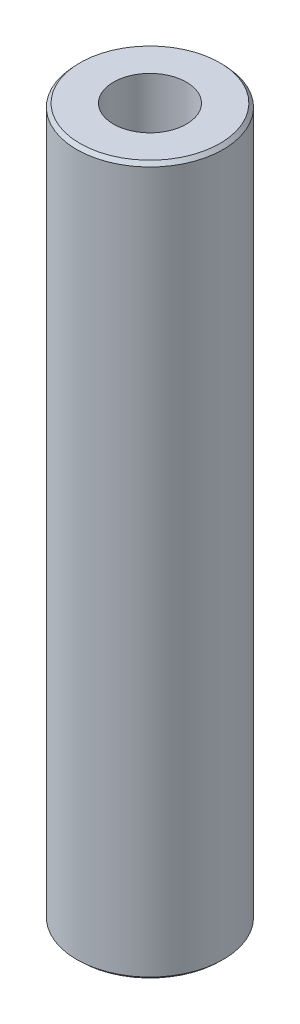
ISO-10303-21;
HEADER;
FILE_DESCRIPTION(('STEP AP214'),'2;1');
FILE_NAME('part.step','',(''),(''),'','','');
FILE_SCHEMA(('AUTOMOTIVE_DESIGN { 1 0 10303 214 1 1 1 1 }'));
ENDSEC;
DATA;
#1=APPLICATION_CONTEXT('core data for automotive mechanical design processes');
#2=APPLICATION_PROTOCOL_DEFINITION('international standard','automotive_design',2000,#1);
#3=PRODUCT_CONTEXT('',#1,'mechanical');
#4=PRODUCT('Part','Part','',(#3));
#5=PRODUCT_RELATED_PRODUCT_CATEGORY('part','',(#4));
#6=PRODUCT_DEFINITION_FORMATION('','',#4);
#7=PRODUCT_DEFINITION_CONTEXT('part definition',#1,'design');
#8=PRODUCT_DEFINITION('design','',#6,#7);
#9=PRODUCT_DEFINITION_SHAPE('','',#8);
#10=(LENGTH_UNIT() NAMED_UNIT(*) SI_UNIT(.MILLI.,.METRE.));
#11=(NAMED_UNIT(*) PLANE_ANGLE_UNIT() SI_UNIT($,.RADIAN.));
#12=(NAMED_UNIT(*) SI_UNIT($,.STERADIAN.) SOLID_ANGLE_UNIT());
#13=UNCERTAINTY_MEASURE_WITH_UNIT(LENGTH_MEASURE(1.E-05),#10,'distance_accuracy_value','');
#14=(GEOMETRIC_REPRESENTATION_CONTEXT(3) GLOBAL_UNCERTAINTY_ASSIGNED_CONTEXT((#13)) GLOBAL_UNIT_ASSIGNED_CONTEXT((#10,
#11,#12)) REPRESENTATION_CONTEXT('',''));
#15=CARTESIAN_POINT('',(0.,0.,0.));
#16=DIRECTION('',(0.,0.,1.));
#17=DIRECTION('',(1.,0.,0.));
#18=AXIS2_PLACEMENT_3D('',#15,#16,#17);
#19=CARTESIAN_POINT('',(0.,580.026093204039,0.));
#20=DIRECTION('',(0.,-1.,0.));
#21=DIRECTION('',(0.,0.,-1.));
#22=AXIS2_PLACEMENT_3D('',#19,#20,#21);
#23=CYLINDRICAL_SURFACE('',#22,60.);
#24=CARTESIAN_POINT('',(0.,577.120088363614,0.));
#25=DIRECTION('',(0.,1.,0.));
#26=DIRECTION('',(0.,0.,1.));
#27=AXIS2_PLACEMENT_3D('',#24,#25,#26);
#28=CIRCLE('',#27,60.);
#29=CARTESIAN_POINT('',(0.,577.120088363614,60.));
#30=VERTEX_POINT('',#29);
#31=EDGE_CURVE('E50',#30,#30,#28,.F.);
#32=ORIENTED_EDGE('',*,*,#31,.T.);
#33=EDGE_LOOP('',(#32));
#34=FACE_BOUND('',#33,.T.);
#35=CARTESIAN_POINT('',(0.,2.71598734658796,0.));
#36=DIRECTION('',(0.,1.,0.));
#37=DIRECTION('',(0.,0.,1.));
#38=AXIS2_PLACEMENT_3D('',#35,#36,#37);
#39=CIRCLE('',#38,60.);
#40=CARTESIAN_POINT('',(0.,2.71598734658796,60.));
#41=VERTEX_POINT('',#40);
#42=EDGE_CURVE('E51',#41,#41,#39,.T.);
#43=ORIENTED_EDGE('',*,*,#42,.T.);
#44=EDGE_LOOP('',(#43));
#45=FACE_BOUND('',#44,.T.);
#46=ADVANCED_FACE('F39',(#34,#45),#23,.T.);
#47=CARTESIAN_POINT('',(0.,580.026093204039,0.));
#48=DIRECTION('',(0.,1.,0.));
#49=DIRECTION('',(0.,0.,1.));
#50=AXIS2_PLACEMENT_3D('',#47,#48,#49);
#51=PLANE('',#50);
#52=CARTESIAN_POINT('',(0.,580.026093204039,0.));
#53=DIRECTION('',(0.,1.,0.));
#54=DIRECTION('',(0.,0.,1.));
#55=AXIS2_PLACEMENT_3D('',#52,#53,#54);
#56=CIRCLE('',#55,57.2840126534121);
#57=CARTESIAN_POINT('',(0.,580.026093204039,57.2840126534121));
#58=VERTEX_POINT('',#57);
#59=EDGE_CURVE('E54',#58,#58,#56,.T.);
#60=ORIENTED_EDGE('',*,*,#59,.T.);
#61=EDGE_LOOP('',(#60));
#62=FACE_BOUND('',#61,.T.);
#63=CARTESIAN_POINT('',(0.,580.026093204039,0.));
#64=DIRECTION('',(0.,1.,0.));
#65=DIRECTION('',(0.,0.,1.));
#66=AXIS2_PLACEMENT_3D('',#63,#64,#65);
#67=CIRCLE('',#66,29.8430529050498);
#68=CARTESIAN_POINT('',(0.,580.026093204039,29.8430529050498));
#69=VERTEX_POINT('',#68);
#70=EDGE_CURVE('E58',#69,#69,#67,.T.);
#71=ORIENTED_EDGE('',*,*,#70,.F.);
#72=EDGE_LOOP('',(#71));
#73=FACE_BOUND('',#72,.T.);
#74=ADVANCED_FACE('F69',(#62,#73),#51,.T.);
#75=CARTESIAN_POINT('',(0.,0.,0.));
#76=DIRECTION('',(0.,1.,0.));
#77=DIRECTION('',(0.,0.,1.));
#78=AXIS2_PLACEMENT_3D('',#75,#76,#77);
#79=PLANE('',#78);
#80=CARTESIAN_POINT('',(0.,0.,0.));
#81=DIRECTION('',(0.,1.,0.));
#82=DIRECTION('',(0.,0.,1.));
#83=AXIS2_PLACEMENT_3D('',#80,#81,#82);
#84=CIRCLE('',#83,57.0939951595743);
#85=CARTESIAN_POINT('',(0.,0.,57.0939951595743));
#86=VERTEX_POINT('',#85);
#87=EDGE_CURVE('E10',#86,#86,#84,.F.);
#88=ORIENTED_EDGE('',*,*,#87,.T.);
#89=EDGE_LOOP('',(#88));
#90=FACE_BOUND('',#89,.T.);
#91=CARTESIAN_POINT('',(0.,0.,0.));
#92=DIRECTION('',(0.,1.,0.));
#93=DIRECTION('',(0.,0.,1.));
#94=AXIS2_PLACEMENT_3D('',#91,#92,#93);
#95=CIRCLE('',#94,29.8430529050498);
#96=CARTESIAN_POINT('',(0.,0.,29.8430529050498));
#97=VERTEX_POINT('',#96);
#98=EDGE_CURVE('E63',#97,#97,#95,.T.);
#99=ORIENTED_EDGE('',*,*,#98,.T.);
#100=EDGE_LOOP('',(#99));
#101=FACE_BOUND('',#100,.T.);
#102=ADVANCED_FACE('F75',(#90,#101),#79,.F.);
#103=CARTESIAN_POINT('',(0.,580.026093204039,0.));
#104=DIRECTION('',(0.,-1.,0.));
#105=DIRECTION('',(0.,0.,-1.));
#106=AXIS2_PLACEMENT_3D('',#103,#104,#105);
#107=CYLINDRICAL_SURFACE('',#106,29.8430529050498);
#108=ORIENTED_EDGE('',*,*,#70,.T.);
#109=EDGE_LOOP('',(#108));
#110=FACE_BOUND('',#109,.T.);
#111=ORIENTED_EDGE('',*,*,#98,.F.);
#112=EDGE_LOOP('',(#111));
#113=FACE_BOUND('',#112,.T.);
#114=ADVANCED_FACE('F70',(#110,#113),#107,.F.);
#115=CARTESIAN_POINT('',(0.,580.026093204039,0.));
#116=DIRECTION('',(0.,-1.,0.));
#117=DIRECTION('',(0.,0.,-1.));
#118=AXIS2_PLACEMENT_3D('',#115,#116,#117);
#119=CONICAL_SURFACE('',#118,57.2840126534121,0.751612064034847);
#120=ORIENTED_EDGE('',*,*,#31,.F.);
#121=EDGE_LOOP('',(#120));
#122=FACE_BOUND('',#121,.T.);
#123=ORIENTED_EDGE('',*,*,#59,.F.);
#124=EDGE_LOOP('',(#123));
#125=FACE_BOUND('',#124,.T.);
#126=ADVANCED_FACE('F81',(#122,#125),#119,.T.);
#127=CARTESIAN_POINT('',(0.,2.71598734658796,0.));
#128=DIRECTION('',(0.,1.,0.));
#129=DIRECTION('',(0.,0.,1.));
#130=AXIS2_PLACEMENT_3D('',#127,#128,#129);
#131=CONICAL_SURFACE('',#130,60.,0.819184262760058);
#132=ORIENTED_EDGE('',*,*,#87,.F.);
#133=EDGE_LOOP('',(#132));
#134=FACE_BOUND('',#133,.T.);
#135=ORIENTED_EDGE('',*,*,#42,.F.);
#136=EDGE_LOOP('',(#135));
#137=FACE_BOUND('',#136,.T.);
#138=ADVANCED_FACE('F45',(#134,#137),#131,.T.);
#139=CLOSED_SHELL('',(#46,#74,#102,#114,#126,#138));
#140=MANIFOLD_SOLID_BREP('B2',#139);
#141=ADVANCED_BREP_SHAPE_REPRESENTATION('',(#18,#140),#14);
#142=SHAPE_DEFINITION_REPRESENTATION(#9,#141);
ENDSEC;
END-ISO-10303-21;
